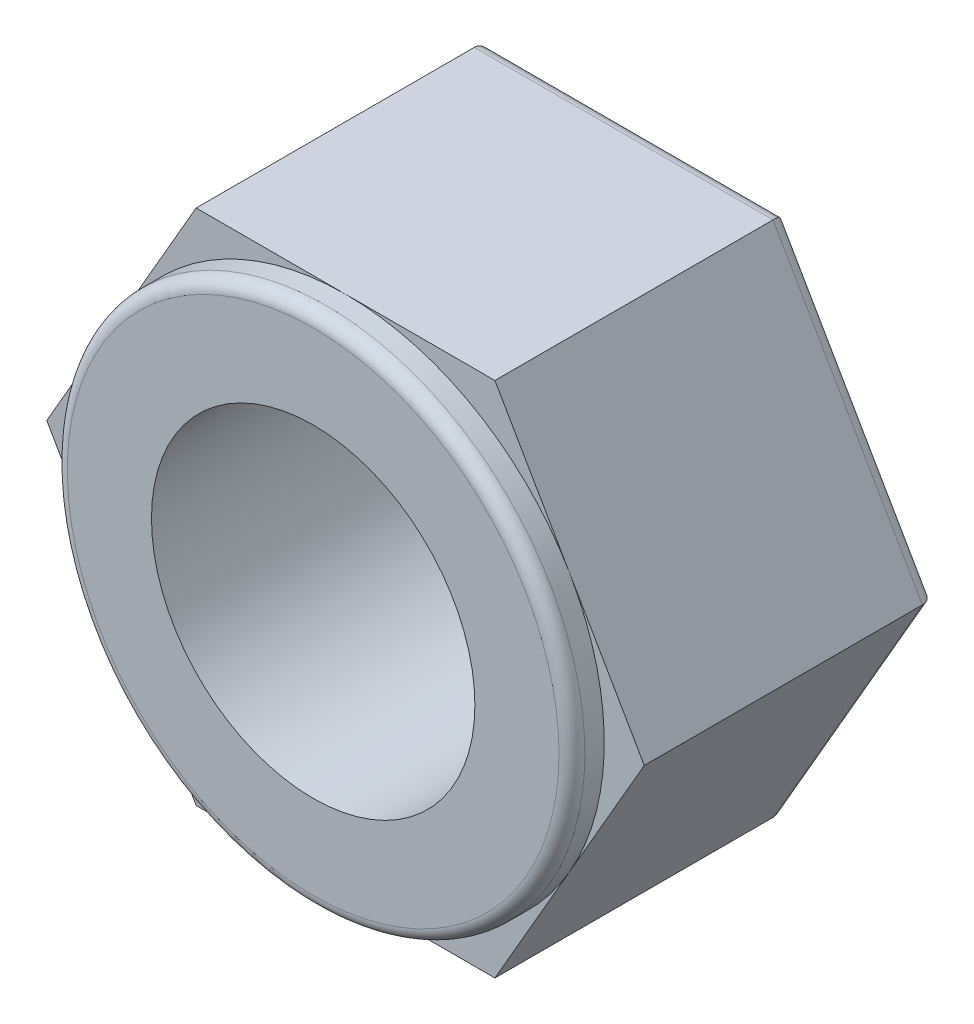
ISO-10303-21;
HEADER;
FILE_DESCRIPTION(('STEP AP214'),'2;1');
FILE_NAME('part.step','',(''),(''),'','','');
FILE_SCHEMA(('AUTOMOTIVE_DESIGN { 1 0 10303 214 1 1 1 1 }'));
ENDSEC;
DATA;
#1=APPLICATION_CONTEXT('core data for automotive mechanical design processes');
#2=APPLICATION_PROTOCOL_DEFINITION('international standard','automotive_design',2000,#1);
#3=PRODUCT_CONTEXT('',#1,'mechanical');
#4=PRODUCT('Part','Part','',(#3));
#5=PRODUCT_RELATED_PRODUCT_CATEGORY('part','',(#4));
#6=PRODUCT_DEFINITION_FORMATION('','',#4);
#7=PRODUCT_DEFINITION_CONTEXT('part definition',#1,'design');
#8=PRODUCT_DEFINITION('design','',#6,#7);
#9=PRODUCT_DEFINITION_SHAPE('','',#8);
#10=(LENGTH_UNIT() NAMED_UNIT(*) SI_UNIT(.MILLI.,.METRE.));
#11=(NAMED_UNIT(*) PLANE_ANGLE_UNIT() SI_UNIT($,.RADIAN.));
#12=(NAMED_UNIT(*) SI_UNIT($,.STERADIAN.) SOLID_ANGLE_UNIT());
#13=UNCERTAINTY_MEASURE_WITH_UNIT(LENGTH_MEASURE(1.E-05),#10,'distance_accuracy_value','');
#14=(GEOMETRIC_REPRESENTATION_CONTEXT(3) GLOBAL_UNCERTAINTY_ASSIGNED_CONTEXT((#13)) GLOBAL_UNIT_ASSIGNED_CONTEXT((#10,
#11,#12)) REPRESENTATION_CONTEXT('',''));
#15=CARTESIAN_POINT('',(0.,0.,0.));
#16=DIRECTION('',(0.,0.,1.));
#17=DIRECTION('',(1.,0.,0.));
#18=AXIS2_PLACEMENT_3D('',#15,#16,#17);
#19=CARTESIAN_POINT('',(0.,0.,4.5));
#20=DIRECTION('',(0.,0.,1.));
#21=DIRECTION('',(1.,0.,0.));
#22=AXIS2_PLACEMENT_3D('',#19,#20,#21);
#23=PLANE('',#22);
#24=CARTESIAN_POINT('',(0.,0.,4.5));
#25=DIRECTION('',(0.,0.,1.));
#26=DIRECTION('',(1.,0.,0.));
#27=AXIS2_PLACEMENT_3D('',#24,#25,#26);
#28=CIRCLE('',#27,4.00000000000002);
#29=CARTESIAN_POINT('',(3.46410161513777,2.00000000000001,4.5));
#30=VERTEX_POINT('',#29);
#31=CARTESIAN_POINT('',(0.,4.,4.5));
#32=VERTEX_POINT('',#31);
#33=EDGE_CURVE('E160',#30,#32,#28,.T.);
#34=ORIENTED_EDGE('',*,*,#33,.F.);
#35=DIRECTION('',(-0.500000000000001,0.866025403784438,0.));
#36=VECTOR('',#35,1.);
#37=CARTESIAN_POINT('',(4.61880215351701,0.,4.5));
#38=LINE('',#37,#36);
#39=CARTESIAN_POINT('',(2.3094010767585,4.00000000000001,4.5));
#40=VERTEX_POINT('',#39);
#41=EDGE_CURVE('E147',#30,#40,#38,.T.);
#42=ORIENTED_EDGE('',*,*,#41,.T.);
#43=DIRECTION('',(-1.,0.,0.));
#44=VECTOR('',#43,1.);
#45=CARTESIAN_POINT('',(2.3094010767585,4.00000000000001,4.5));
#46=LINE('',#45,#44);
#47=EDGE_CURVE('E161',#40,#32,#46,.T.);
#48=ORIENTED_EDGE('',*,*,#47,.T.);
#49=EDGE_LOOP('',(#34,#42,#48));
#50=FACE_BOUND('',#49,.T.);
#51=ADVANCED_FACE('F43',(#50),#23,.T.);
#52=CARTESIAN_POINT('',(-3.46410161513777,1.99999999999998,4.5));
#53=VERTEX_POINT('',#52);
#54=EDGE_CURVE('E168',#32,#53,#28,.T.);
#55=ORIENTED_EDGE('',*,*,#54,.F.);
#56=CARTESIAN_POINT('',(-2.30940107675852,3.99999999999999,4.5));
#57=VERTEX_POINT('',#56);
#58=EDGE_CURVE('E146',#32,#57,#46,.T.);
#59=ORIENTED_EDGE('',*,*,#58,.T.);
#60=DIRECTION('',(-0.499999999999995,-0.866025403784441,0.));
#61=VECTOR('',#60,1.);
#62=CARTESIAN_POINT('',(-2.30940107675852,3.99999999999999,4.5));
#63=LINE('',#62,#61);
#64=EDGE_CURVE('E190',#57,#53,#63,.T.);
#65=ORIENTED_EDGE('',*,*,#64,.T.);
#66=EDGE_LOOP('',(#55,#59,#65));
#67=FACE_BOUND('',#66,.T.);
#68=ADVANCED_FACE('F306',(#67),#23,.T.);
#69=CARTESIAN_POINT('',(-3.46410161513774,-2.00000000000003,4.5));
#70=VERTEX_POINT('',#69);
#71=EDGE_CURVE('E337',#53,#70,#28,.T.);
#72=ORIENTED_EDGE('',*,*,#71,.F.);
#73=CARTESIAN_POINT('',(-4.61880215351701,0.,4.5));
#74=VERTEX_POINT('',#73);
#75=EDGE_CURVE('E189',#53,#74,#63,.T.);
#76=ORIENTED_EDGE('',*,*,#75,.T.);
#77=DIRECTION('',(0.500000000000007,-0.866025403784434,0.));
#78=VECTOR('',#77,1.);
#79=CARTESIAN_POINT('',(-4.61880215351701,0.,4.5));
#80=LINE('',#79,#78);
#81=EDGE_CURVE('E195',#74,#70,#80,.T.);
#82=ORIENTED_EDGE('',*,*,#81,.T.);
#83=EDGE_LOOP('',(#72,#76,#82));
#84=FACE_BOUND('',#83,.T.);
#85=ADVANCED_FACE('F311',(#84),#23,.T.);
#86=CARTESIAN_POINT('',(0.,-4.,4.5));
#87=VERTEX_POINT('',#86);
#88=EDGE_CURVE('E177',#70,#87,#28,.T.);
#89=ORIENTED_EDGE('',*,*,#88,.F.);
#90=CARTESIAN_POINT('',(-2.30940107675847,-4.00000000000002,4.5));
#91=VERTEX_POINT('',#90);
#92=EDGE_CURVE('E194',#70,#91,#80,.T.);
#93=ORIENTED_EDGE('',*,*,#92,.T.);
#94=DIRECTION('',(1.,0.,0.));
#95=VECTOR('',#94,1.);
#96=CARTESIAN_POINT('',(-2.30940107675847,-4.00000000000002,4.5));
#97=LINE('',#96,#95);
#98=EDGE_CURVE('E200',#91,#87,#97,.T.);
#99=ORIENTED_EDGE('',*,*,#98,.T.);
#100=EDGE_LOOP('',(#89,#93,#99));
#101=FACE_BOUND('',#100,.T.);
#102=ADVANCED_FACE('F323',(#101),#23,.T.);
#103=CARTESIAN_POINT('',(3.46410161513778,-1.99999999999999,4.5));
#104=VERTEX_POINT('',#103);
#105=EDGE_CURVE('E172',#87,#104,#28,.T.);
#106=ORIENTED_EDGE('',*,*,#105,.F.);
#107=CARTESIAN_POINT('',(2.30940107675855,-3.99999999999998,4.5));
#108=VERTEX_POINT('',#107);
#109=EDGE_CURVE('E199',#87,#108,#97,.T.);
#110=ORIENTED_EDGE('',*,*,#109,.T.);
#111=DIRECTION('',(0.499999999999995,0.866025403784441,0.));
#112=VECTOR('',#111,1.);
#113=CARTESIAN_POINT('',(2.30940107675855,-3.99999999999998,4.5));
#114=LINE('',#113,#112);
#115=EDGE_CURVE('E158',#108,#104,#114,.T.);
#116=ORIENTED_EDGE('',*,*,#115,.T.);
#117=EDGE_LOOP('',(#106,#110,#116));
#118=FACE_BOUND('',#117,.T.);
#119=ADVANCED_FACE('F316',(#118),#23,.T.);
#120=EDGE_CURVE('E139',#104,#30,#28,.T.);
#121=ORIENTED_EDGE('',*,*,#120,.F.);
#122=CARTESIAN_POINT('',(4.61880215351701,0.,4.5));
#123=VERTEX_POINT('',#122);
#124=EDGE_CURVE('E141',#104,#123,#114,.T.);
#125=ORIENTED_EDGE('',*,*,#124,.T.);
#126=EDGE_CURVE('E135',#123,#30,#38,.T.);
#127=ORIENTED_EDGE('',*,*,#126,.T.);
#128=EDGE_LOOP('',(#121,#125,#127));
#129=FACE_BOUND('',#128,.T.);
#130=ADVANCED_FACE('F137',(#129),#23,.T.);
#131=CARTESIAN_POINT('',(0.,0.,0.));
#132=DIRECTION('',(0.,0.,1.));
#133=DIRECTION('',(1.,0.,0.));
#134=AXIS2_PLACEMENT_3D('',#131,#132,#133);
#135=PLANE('',#134);
#136=DIRECTION('',(-0.500000000000001,0.866025403784438,0.));
#137=VECTOR('',#136,1.);
#138=CARTESIAN_POINT('',(3.29089653438087,1.9,0.));
#139=LINE('',#138,#137);
#140=CARTESIAN_POINT('',(2.19393102292057,3.80000000000001,0.));
#141=VERTEX_POINT('',#140);
#142=CARTESIAN_POINT('',(4.38786204584116,0.,0.));
#143=VERTEX_POINT('',#142);
#144=EDGE_CURVE('E243',#141,#143,#139,.F.);
#145=ORIENTED_EDGE('',*,*,#144,.T.);
#146=DIRECTION('',(0.499999999999995,0.866025403784442,0.));
#147=VECTOR('',#146,1.);
#148=CARTESIAN_POINT('',(3.29089653438089,-1.89999999999999,0.));
#149=LINE('',#148,#147);
#150=CARTESIAN_POINT('',(2.19393102292062,-3.79999999999998,0.));
#151=VERTEX_POINT('',#150);
#152=EDGE_CURVE('E246',#143,#151,#149,.F.);
#153=ORIENTED_EDGE('',*,*,#152,.T.);
#154=DIRECTION('',(1.,0.,0.));
#155=VECTOR('',#154,1.);
#156=CARTESIAN_POINT('',(0.,-3.8,0.));
#157=LINE('',#156,#155);
#158=CARTESIAN_POINT('',(-2.19393102292054,-3.80000000000002,0.));
#159=VERTEX_POINT('',#158);
#160=EDGE_CURVE('E231',#151,#159,#157,.F.);
#161=ORIENTED_EDGE('',*,*,#160,.T.);
#162=DIRECTION('',(0.500000000000007,-0.866025403784435,0.));
#163=VECTOR('',#162,1.);
#164=CARTESIAN_POINT('',(-3.29089653438085,-1.90000000000003,0.));
#165=LINE('',#164,#163);
#166=CARTESIAN_POINT('',(-4.38786204584116,0.,0.));
#167=VERTEX_POINT('',#166);
#168=EDGE_CURVE('E234',#159,#167,#165,.F.);
#169=ORIENTED_EDGE('',*,*,#168,.T.);
#170=DIRECTION('',(-0.499999999999995,-0.866025403784442,0.));
#171=VECTOR('',#170,1.);
#172=CARTESIAN_POINT('',(-3.29089653438088,1.89999999999998,0.));
#173=LINE('',#172,#171);
#174=CARTESIAN_POINT('',(-2.1939310229206,3.79999999999999,0.));
#175=VERTEX_POINT('',#174);
#176=EDGE_CURVE('E237',#167,#175,#173,.F.);
#177=ORIENTED_EDGE('',*,*,#176,.T.);
#178=DIRECTION('',(-1.,0.,0.));
#179=VECTOR('',#178,1.);
#180=CARTESIAN_POINT('',(0.,3.8,0.));
#181=LINE('',#180,#179);
#182=EDGE_CURVE('E240',#175,#141,#181,.F.);
#183=ORIENTED_EDGE('',*,*,#182,.T.);
#184=EDGE_LOOP('',(#145,#153,#161,#169,#177,#183));
#185=FACE_BOUND('',#184,.T.);
#186=CARTESIAN_POINT('',(0.,0.,0.));
#187=DIRECTION('',(0.,0.,1.));
#188=DIRECTION('',(1.,0.,0.));
#189=AXIS2_PLACEMENT_3D('',#186,#187,#188);
#190=CIRCLE('',#189,2.5);
#191=CARTESIAN_POINT('',(2.5,0.,0.));
#192=VERTEX_POINT('',#191);
#193=EDGE_CURVE('E165',#192,#192,#190,.T.);
#194=ORIENTED_EDGE('',*,*,#193,.T.);
#195=EDGE_LOOP('',(#194));
#196=FACE_BOUND('',#195,.T.);
#197=ADVANCED_FACE('F315',(#185,#196),#135,.F.);
#198=CARTESIAN_POINT('',(2.30940107675855,-3.99999999999998,4.5));
#199=DIRECTION('',(-0.866025403784441,0.499999999999995,0.));
#200=DIRECTION('',(-0.499999999999995,-0.866025403784442,0.));
#201=AXIS2_PLACEMENT_3D('',#198,#199,#200);
#202=PLANE('',#201);
#203=DIRECTION('',(0.,0.,-1.));
#204=VECTOR('',#203,1.);
#205=CARTESIAN_POINT('',(2.30940107675855,-3.99999999999998,4.5));
#206=LINE('',#205,#204);
#207=CARTESIAN_POINT('',(2.30940107675855,-3.99999999999998,0.2));
#208=VERTEX_POINT('',#207);
#209=EDGE_CURVE('E204',#108,#208,#206,.T.);
#210=ORIENTED_EDGE('',*,*,#209,.T.);
#211=DIRECTION('',(0.499999999999995,0.866025403784442,0.));
#212=VECTOR('',#211,1.);
#213=CARTESIAN_POINT('',(2.30940107675855,-3.99999999999998,0.2));
#214=LINE('',#213,#212);
#215=CARTESIAN_POINT('',(4.61880215351701,0.,0.2));
#216=VERTEX_POINT('',#215);
#217=EDGE_CURVE('E227',#208,#216,#214,.T.);
#218=ORIENTED_EDGE('',*,*,#217,.T.);
#219=DIRECTION('',(0.,0.,-1.));
#220=VECTOR('',#219,1.);
#221=CARTESIAN_POINT('',(4.61880215351701,0.,4.5));
#222=LINE('',#221,#220);
#223=EDGE_CURVE('E174',#123,#216,#222,.T.);
#224=ORIENTED_EDGE('',*,*,#223,.F.);
#225=ORIENTED_EDGE('',*,*,#124,.F.);
#226=ORIENTED_EDGE('',*,*,#115,.F.);
#227=EDGE_LOOP('',(#210,#218,#224,#225,#226));
#228=FACE_BOUND('',#227,.T.);
#229=ADVANCED_FACE('F321',(#228),#202,.F.);
#230=CARTESIAN_POINT('',(4.61880215351701,0.,4.5));
#231=DIRECTION('',(-0.866025403784438,-0.500000000000001,0.));
#232=DIRECTION('',(0.500000000000001,-0.866025403784438,0.));
#233=AXIS2_PLACEMENT_3D('',#230,#231,#232);
#234=PLANE('',#233);
#235=ORIENTED_EDGE('',*,*,#223,.T.);
#236=DIRECTION('',(-0.500000000000001,0.866025403784438,0.));
#237=VECTOR('',#236,1.);
#238=CARTESIAN_POINT('',(4.61880215351701,0.,0.2));
#239=LINE('',#238,#237);
#240=CARTESIAN_POINT('',(2.3094010767585,4.00000000000001,0.2));
#241=VERTEX_POINT('',#240);
#242=EDGE_CURVE('E250',#216,#241,#239,.T.);
#243=ORIENTED_EDGE('',*,*,#242,.T.);
#244=DIRECTION('',(0.,0.,-1.));
#245=VECTOR('',#244,1.);
#246=CARTESIAN_POINT('',(2.3094010767585,4.00000000000001,4.5));
#247=LINE('',#246,#245);
#248=EDGE_CURVE('E153',#40,#241,#247,.T.);
#249=ORIENTED_EDGE('',*,*,#248,.F.);
#250=ORIENTED_EDGE('',*,*,#41,.F.);
#251=ORIENTED_EDGE('',*,*,#126,.F.);
#252=EDGE_LOOP('',(#235,#243,#249,#250,#251));
#253=FACE_BOUND('',#252,.T.);
#254=ADVANCED_FACE('F151',(#253),#234,.F.);
#255=CARTESIAN_POINT('',(2.3094010767585,4.00000000000001,4.5));
#256=DIRECTION('',(0.,-1.,0.));
#257=DIRECTION('',(1.,0.,0.));
#258=AXIS2_PLACEMENT_3D('',#255,#256,#257);
#259=PLANE('',#258);
#260=ORIENTED_EDGE('',*,*,#248,.T.);
#261=DIRECTION('',(-1.,0.,0.));
#262=VECTOR('',#261,1.);
#263=CARTESIAN_POINT('',(2.3094010767585,4.00000000000001,0.2));
#264=LINE('',#263,#262);
#265=CARTESIAN_POINT('',(-2.30940107675852,3.99999999999999,0.2));
#266=VERTEX_POINT('',#265);
#267=EDGE_CURVE('E253',#241,#266,#264,.T.);
#268=ORIENTED_EDGE('',*,*,#267,.T.);
#269=DIRECTION('',(0.,0.,-1.));
#270=VECTOR('',#269,1.);
#271=CARTESIAN_POINT('',(-2.30940107675852,3.99999999999999,4.5));
#272=LINE('',#271,#270);
#273=EDGE_CURVE('E214',#57,#266,#272,.T.);
#274=ORIENTED_EDGE('',*,*,#273,.F.);
#275=ORIENTED_EDGE('',*,*,#58,.F.);
#276=ORIENTED_EDGE('',*,*,#47,.F.);
#277=EDGE_LOOP('',(#260,#268,#274,#275,#276));
#278=FACE_BOUND('',#277,.T.);
#279=ADVANCED_FACE('F345',(#278),#259,.F.);
#280=CARTESIAN_POINT('',(-2.30940107675852,3.99999999999999,4.5));
#281=DIRECTION('',(0.866025403784442,-0.499999999999995,0.));
#282=DIRECTION('',(0.499999999999995,0.866025403784442,0.));
#283=AXIS2_PLACEMENT_3D('',#280,#281,#282);
#284=PLANE('',#283);
#285=ORIENTED_EDGE('',*,*,#273,.T.);
#286=DIRECTION('',(-0.499999999999995,-0.866025403784442,0.));
#287=VECTOR('',#286,1.);
#288=CARTESIAN_POINT('',(-2.30940107675852,3.99999999999999,0.2));
#289=LINE('',#288,#287);
#290=CARTESIAN_POINT('',(-4.61880215351701,0.,0.2));
#291=VERTEX_POINT('',#290);
#292=EDGE_CURVE('E68',#266,#291,#289,.T.);
#293=ORIENTED_EDGE('',*,*,#292,.T.);
#294=DIRECTION('',(0.,0.,-1.));
#295=VECTOR('',#294,1.);
#296=CARTESIAN_POINT('',(-4.61880215351701,0.,4.5));
#297=LINE('',#296,#295);
#298=EDGE_CURVE('E211',#74,#291,#297,.T.);
#299=ORIENTED_EDGE('',*,*,#298,.F.);
#300=ORIENTED_EDGE('',*,*,#75,.F.);
#301=ORIENTED_EDGE('',*,*,#64,.F.);
#302=EDGE_LOOP('',(#285,#293,#299,#300,#301));
#303=FACE_BOUND('',#302,.T.);
#304=ADVANCED_FACE('F353',(#303),#284,.F.);
#305=CARTESIAN_POINT('',(-4.61880215351701,0.,4.5));
#306=DIRECTION('',(0.866025403784434,0.500000000000007,0.));
#307=DIRECTION('',(-0.500000000000007,0.866025403784435,0.));
#308=AXIS2_PLACEMENT_3D('',#305,#306,#307);
#309=PLANE('',#308);
#310=ORIENTED_EDGE('',*,*,#298,.T.);
#311=DIRECTION('',(0.500000000000007,-0.866025403784435,0.));
#312=VECTOR('',#311,1.);
#313=CARTESIAN_POINT('',(-4.61880215351701,0.,0.2));
#314=LINE('',#313,#312);
#315=CARTESIAN_POINT('',(-2.30940107675847,-4.00000000000002,0.2));
#316=VERTEX_POINT('',#315);
#317=EDGE_CURVE('E53',#291,#316,#314,.T.);
#318=ORIENTED_EDGE('',*,*,#317,.T.);
#319=DIRECTION('',(0.,0.,-1.));
#320=VECTOR('',#319,1.);
#321=CARTESIAN_POINT('',(-2.30940107675847,-4.00000000000002,4.5));
#322=LINE('',#321,#320);
#323=EDGE_CURVE('E208',#91,#316,#322,.T.);
#324=ORIENTED_EDGE('',*,*,#323,.F.);
#325=ORIENTED_EDGE('',*,*,#92,.F.);
#326=ORIENTED_EDGE('',*,*,#81,.F.);
#327=EDGE_LOOP('',(#310,#318,#324,#325,#326));
#328=FACE_BOUND('',#327,.T.);
#329=ADVANCED_FACE('F354',(#328),#309,.F.);
#330=CARTESIAN_POINT('',(-2.30940107675847,-4.00000000000002,4.5));
#331=DIRECTION('',(0.,1.,0.));
#332=DIRECTION('',(-1.,0.,0.));
#333=AXIS2_PLACEMENT_3D('',#330,#331,#332);
#334=PLANE('',#333);
#335=ORIENTED_EDGE('',*,*,#323,.T.);
#336=DIRECTION('',(1.,0.,0.));
#337=VECTOR('',#336,1.);
#338=CARTESIAN_POINT('',(-2.30940107675847,-4.00000000000002,0.2));
#339=LINE('',#338,#337);
#340=EDGE_CURVE('E11',#316,#208,#339,.T.);
#341=ORIENTED_EDGE('',*,*,#340,.T.);
#342=ORIENTED_EDGE('',*,*,#209,.F.);
#343=ORIENTED_EDGE('',*,*,#109,.F.);
#344=ORIENTED_EDGE('',*,*,#98,.F.);
#345=EDGE_LOOP('',(#335,#341,#342,#343,#344));
#346=FACE_BOUND('',#345,.T.);
#347=ADVANCED_FACE('F302',(#346),#334,.F.);
#348=CARTESIAN_POINT('',(0.,0.,4.5));
#349=DIRECTION('',(0.,0.,-1.));
#350=DIRECTION('',(-1.,0.,0.));
#351=AXIS2_PLACEMENT_3D('',#348,#349,#350);
#352=CYLINDRICAL_SURFACE('',#351,2.5);
#353=ORIENTED_EDGE('',*,*,#193,.F.);
#354=EDGE_LOOP('',(#353));
#355=FACE_BOUND('',#354,.T.);
#356=CARTESIAN_POINT('',(0.,0.,5.));
#357=DIRECTION('',(0.,0.,1.));
#358=DIRECTION('',(1.,0.,0.));
#359=AXIS2_PLACEMENT_3D('',#356,#357,#358);
#360=CIRCLE('',#359,2.5);
#361=CARTESIAN_POINT('',(2.5,0.,5.));
#362=VERTEX_POINT('',#361);
#363=EDGE_CURVE('E166',#362,#362,#360,.T.);
#364=ORIENTED_EDGE('',*,*,#363,.T.);
#365=EDGE_LOOP('',(#364));
#366=FACE_BOUND('',#365,.T.);
#367=ADVANCED_FACE('F289',(#355,#366),#352,.F.);
#368=CARTESIAN_POINT('',(0.,0.,5.));
#369=DIRECTION('',(0.,0.,1.));
#370=DIRECTION('',(1.,0.,0.));
#371=AXIS2_PLACEMENT_3D('',#368,#369,#370);
#372=PLANE('',#371);
#373=CARTESIAN_POINT('',(0.,0.,5.));
#374=DIRECTION('',(0.,0.,1.));
#375=DIRECTION('',(1.,0.,0.));
#376=AXIS2_PLACEMENT_3D('',#373,#374,#375);
#377=CIRCLE('',#376,3.80000000000002);
#378=CARTESIAN_POINT('',(3.80000000000002,0.,5.));
#379=VERTEX_POINT('',#378);
#380=EDGE_CURVE('E219',#379,#379,#377,.T.);
#381=ORIENTED_EDGE('',*,*,#380,.T.);
#382=EDGE_LOOP('',(#381));
#383=FACE_BOUND('',#382,.T.);
#384=ORIENTED_EDGE('',*,*,#363,.F.);
#385=EDGE_LOOP('',(#384));
#386=FACE_BOUND('',#385,.T.);
#387=ADVANCED_FACE('F291',(#383,#386),#372,.T.);
#388=CARTESIAN_POINT('',(0.,0.,5.));
#389=DIRECTION('',(0.,0.,-1.));
#390=DIRECTION('',(-1.,0.,0.));
#391=AXIS2_PLACEMENT_3D('',#388,#389,#390);
#392=CYLINDRICAL_SURFACE('',#391,4.00000000000002);
#393=CARTESIAN_POINT('',(0.,0.,4.8));
#394=DIRECTION('',(0.,0.,1.));
#395=DIRECTION('',(1.,0.,0.));
#396=AXIS2_PLACEMENT_3D('',#393,#394,#395);
#397=CIRCLE('',#396,4.00000000000002);
#398=CARTESIAN_POINT('',(4.00000000000002,0.,4.8));
#399=VERTEX_POINT('',#398);
#400=EDGE_CURVE('E223',#399,#399,#397,.F.);
#401=ORIENTED_EDGE('',*,*,#400,.T.);
#402=EDGE_LOOP('',(#401));
#403=FACE_BOUND('',#402,.T.);
#404=ORIENTED_EDGE('',*,*,#33,.T.);
#405=ORIENTED_EDGE('',*,*,#54,.T.);
#406=ORIENTED_EDGE('',*,*,#71,.T.);
#407=ORIENTED_EDGE('',*,*,#88,.T.);
#408=ORIENTED_EDGE('',*,*,#105,.T.);
#409=ORIENTED_EDGE('',*,*,#120,.T.);
#410=EDGE_LOOP('',(#404,#405,#406,#407,#408,#409));
#411=FACE_BOUND('',#410,.T.);
#412=ADVANCED_FACE('F170',(#403,#411),#392,.T.);
#413=CARTESIAN_POINT('',(0.,0.,4.8));
#414=DIRECTION('',(0.,0.,1.));
#415=DIRECTION('',(1.,0.,0.));
#416=AXIS2_PLACEMENT_3D('',#413,#414,#415);
#417=TOROIDAL_SURFACE('',#416,3.80000000000002,0.2);
#418=ORIENTED_EDGE('',*,*,#400,.F.);
#419=EDGE_LOOP('',(#418));
#420=FACE_BOUND('',#419,.T.);
#421=ORIENTED_EDGE('',*,*,#380,.F.);
#422=EDGE_LOOP('',(#421));
#423=FACE_BOUND('',#422,.T.);
#424=ADVANCED_FACE('F299',(#420,#423),#417,.T.);
#425=CARTESIAN_POINT('',(-2.13619599600163,3.89999999999999,0.2));
#426=DIRECTION('',(-0.499999999999995,-0.866025403784442,0.));
#427=DIRECTION('',(0.866025403784442,-0.499999999999995,0.));
#428=AXIS2_PLACEMENT_3D('',#425,#426,#427);
#429=CYLINDRICAL_SURFACE('',#428,0.2);
#430=CARTESIAN_POINT('',(-2.1939310229206,3.79999999999999,0.2));
#431=DIRECTION('',(-0.866025403784436,-0.500000000000004,0.));
#432=DIRECTION('',(0.500000000000004,-0.866025403784436,0.));
#433=AXIS2_PLACEMENT_3D('',#430,#431,#432);
#434=ELLIPSE('',#433,0.23094010767585,0.2);
#435=EDGE_CURVE('E273',#175,#266,#434,.F.);
#436=ORIENTED_EDGE('',*,*,#435,.F.);
#437=ORIENTED_EDGE('',*,*,#176,.F.);
#438=CARTESIAN_POINT('',(-4.38786204584116,0.,0.2));
#439=DIRECTION('',(0.,-1.,0.));
#440=DIRECTION('',(1.,0.,0.));
#441=AXIS2_PLACEMENT_3D('',#438,#439,#440);
#442=ELLIPSE('',#441,0.23094010767585,0.2);
#443=EDGE_CURVE('E47',#291,#167,#442,.T.);
#444=ORIENTED_EDGE('',*,*,#443,.F.);
#445=ORIENTED_EDGE('',*,*,#292,.F.);
#446=EDGE_LOOP('',(#436,#437,#444,#445));
#447=FACE_BOUND('',#446,.T.);
#448=ADVANCED_FACE('F45',(#447),#429,.T.);
#449=CARTESIAN_POINT('',(-4.44559707276012,0.0999999999999691,0.2));
#450=DIRECTION('',(0.500000000000007,-0.866025403784435,0.));
#451=DIRECTION('',(0.866025403784434,0.500000000000007,0.));
#452=AXIS2_PLACEMENT_3D('',#449,#450,#451);
#453=CYLINDRICAL_SURFACE('',#452,0.2);
#454=ORIENTED_EDGE('',*,*,#443,.T.);
#455=ORIENTED_EDGE('',*,*,#168,.F.);
#456=CARTESIAN_POINT('',(-2.19393102292054,-3.80000000000002,0.2));
#457=DIRECTION('',(0.866025403784443,-0.499999999999992,0.));
#458=DIRECTION('',(0.499999999999992,0.866025403784443,0.));
#459=AXIS2_PLACEMENT_3D('',#456,#457,#458);
#460=ELLIPSE('',#459,0.23094010767585,0.2);
#461=EDGE_CURVE('E270',#316,#159,#460,.T.);
#462=ORIENTED_EDGE('',*,*,#461,.F.);
#463=ORIENTED_EDGE('',*,*,#317,.F.);
#464=EDGE_LOOP('',(#454,#455,#462,#463));
#465=FACE_BOUND('',#464,.T.);
#466=ADVANCED_FACE('F357',(#465),#453,.T.);
#467=CARTESIAN_POINT('',(2.3094010767585,3.80000000000001,0.2));
#468=DIRECTION('',(-1.,0.,0.));
#469=DIRECTION('',(0.,-1.,0.));
#470=AXIS2_PLACEMENT_3D('',#467,#468,#469);
#471=CYLINDRICAL_SURFACE('',#470,0.2);
#472=ORIENTED_EDGE('',*,*,#435,.T.);
#473=ORIENTED_EDGE('',*,*,#267,.F.);
#474=CARTESIAN_POINT('',(2.19393102292057,3.80000000000001,0.2));
#475=DIRECTION('',(-0.86602540378444,0.499999999999998,0.));
#476=DIRECTION('',(-0.499999999999998,-0.86602540378444,0.));
#477=AXIS2_PLACEMENT_3D('',#474,#475,#476);
#478=ELLIPSE('',#477,0.23094010767585,0.2);
#479=EDGE_CURVE('E266',#141,#241,#478,.F.);
#480=ORIENTED_EDGE('',*,*,#479,.F.);
#481=ORIENTED_EDGE('',*,*,#182,.F.);
#482=EDGE_LOOP('',(#472,#473,#480,#481));
#483=FACE_BOUND('',#482,.T.);
#484=ADVANCED_FACE('F371',(#483),#471,.T.);
#485=CARTESIAN_POINT('',(-2.30940107675847,-3.80000000000003,0.2));
#486=DIRECTION('',(1.,0.,0.));
#487=DIRECTION('',(0.,1.,0.));
#488=AXIS2_PLACEMENT_3D('',#485,#486,#487);
#489=CYLINDRICAL_SURFACE('',#488,0.2);
#490=ORIENTED_EDGE('',*,*,#461,.T.);
#491=ORIENTED_EDGE('',*,*,#160,.F.);
#492=CARTESIAN_POINT('',(2.19393102292062,-3.79999999999998,0.2));
#493=DIRECTION('',(0.866025403784435,0.500000000000007,0.));
#494=DIRECTION('',(0.500000000000007,-0.866025403784435,0.));
#495=AXIS2_PLACEMENT_3D('',#492,#493,#494);
#496=ELLIPSE('',#495,0.23094010767585,0.2);
#497=EDGE_CURVE('E263',#208,#151,#496,.T.);
#498=ORIENTED_EDGE('',*,*,#497,.F.);
#499=ORIENTED_EDGE('',*,*,#340,.F.);
#500=EDGE_LOOP('',(#490,#491,#498,#499));
#501=FACE_BOUND('',#500,.T.);
#502=ADVANCED_FACE('F361',(#501),#489,.T.);
#503=CARTESIAN_POINT('',(4.44559707276012,-0.1,0.2));
#504=DIRECTION('',(-0.500000000000001,0.866025403784438,0.));
#505=DIRECTION('',(-0.866025403784438,-0.500000000000001,0.));
#506=AXIS2_PLACEMENT_3D('',#503,#504,#505);
#507=CYLINDRICAL_SURFACE('',#506,0.2);
#508=ORIENTED_EDGE('',*,*,#479,.T.);
#509=ORIENTED_EDGE('',*,*,#242,.F.);
#510=CARTESIAN_POINT('',(4.38786204584116,0.,0.2));
#511=DIRECTION('',(0.,1.,0.));
#512=DIRECTION('',(-1.,0.,0.));
#513=AXIS2_PLACEMENT_3D('',#510,#511,#512);
#514=ELLIPSE('',#513,0.23094010767585,0.2);
#515=EDGE_CURVE('E260',#143,#216,#514,.F.);
#516=ORIENTED_EDGE('',*,*,#515,.F.);
#517=ORIENTED_EDGE('',*,*,#144,.F.);
#518=EDGE_LOOP('',(#508,#509,#516,#517));
#519=FACE_BOUND('',#518,.T.);
#520=ADVANCED_FACE('F373',(#519),#507,.T.);
#521=CARTESIAN_POINT('',(2.13619599600166,-3.89999999999998,0.2));
#522=DIRECTION('',(0.499999999999995,0.866025403784442,0.));
#523=DIRECTION('',(-0.866025403784442,0.499999999999995,0.));
#524=AXIS2_PLACEMENT_3D('',#521,#522,#523);
#525=CYLINDRICAL_SURFACE('',#524,0.2);
#526=ORIENTED_EDGE('',*,*,#497,.T.);
#527=ORIENTED_EDGE('',*,*,#152,.F.);
#528=ORIENTED_EDGE('',*,*,#515,.T.);
#529=ORIENTED_EDGE('',*,*,#217,.F.);
#530=EDGE_LOOP('',(#526,#527,#528,#529));
#531=FACE_BOUND('',#530,.T.);
#532=ADVANCED_FACE('F365',(#531),#525,.T.);
#533=CLOSED_SHELL('',(#51,#68,#85,#102,#119,#130,#197,#229,#254,#279,#304,#329,#347,#367,#387,
#412,#424,#448,#466,#484,#502,#520,#532));
#534=MANIFOLD_SOLID_BREP('B2',#533);
#535=ADVANCED_BREP_SHAPE_REPRESENTATION('',(#18,#534),#14);
#536=SHAPE_DEFINITION_REPRESENTATION(#9,#535);
ENDSEC;
END-ISO-10303-21;
